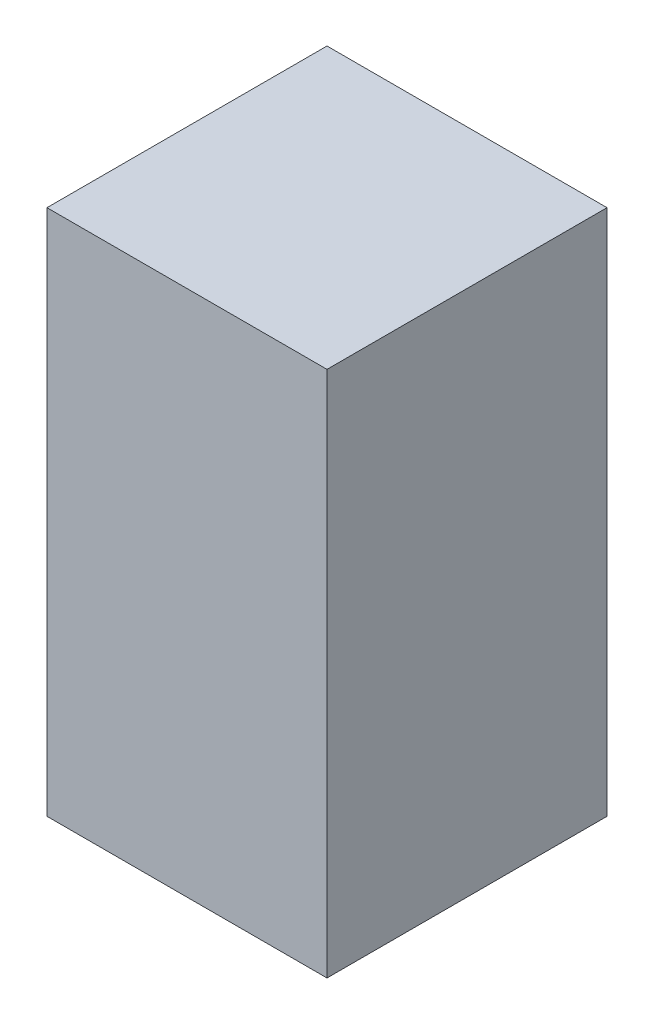
ISO-10303-21;
HEADER;
FILE_DESCRIPTION(('STEP AP214'),'2;1');
FILE_NAME('part.step','',(''),(''),'','','');
FILE_SCHEMA(('AUTOMOTIVE_DESIGN { 1 0 10303 214 1 1 1 1 }'));
ENDSEC;
DATA;
#1=APPLICATION_CONTEXT('core data for automotive mechanical design processes');
#2=APPLICATION_PROTOCOL_DEFINITION('international standard','automotive_design',2000,#1);
#3=PRODUCT_CONTEXT('',#1,'mechanical');
#4=PRODUCT('Part','Part','',(#3));
#5=PRODUCT_RELATED_PRODUCT_CATEGORY('part','',(#4));
#6=PRODUCT_DEFINITION_FORMATION('','',#4);
#7=PRODUCT_DEFINITION_CONTEXT('part definition',#1,'design');
#8=PRODUCT_DEFINITION('design','',#6,#7);
#9=PRODUCT_DEFINITION_SHAPE('','',#8);
#10=(LENGTH_UNIT() NAMED_UNIT(*) SI_UNIT(.MILLI.,.METRE.));
#11=(NAMED_UNIT(*) PLANE_ANGLE_UNIT() SI_UNIT($,.RADIAN.));
#12=(NAMED_UNIT(*) SI_UNIT($,.STERADIAN.) SOLID_ANGLE_UNIT());
#13=UNCERTAINTY_MEASURE_WITH_UNIT(LENGTH_MEASURE(1.E-05),#10,'distance_accuracy_value','');
#14=(GEOMETRIC_REPRESENTATION_CONTEXT(3) GLOBAL_UNCERTAINTY_ASSIGNED_CONTEXT((#13)) GLOBAL_UNIT_ASSIGNED_CONTEXT((#10,
#11,#12)) REPRESENTATION_CONTEXT('',''));
#15=CARTESIAN_POINT('',(0.,0.,0.));
#16=DIRECTION('',(0.,0.,1.));
#17=DIRECTION('',(1.,0.,0.));
#18=AXIS2_PLACEMENT_3D('',#15,#16,#17);
#19=CARTESIAN_POINT('',(26.9875,101.6,26.9875));
#20=DIRECTION('',(-1.,0.,0.));
#21=DIRECTION('',(0.,0.,1.));
#22=AXIS2_PLACEMENT_3D('',#19,#20,#21);
#23=PLANE('',#22);
#24=DIRECTION('',(0.,0.,-1.));
#25=VECTOR('',#24,1.);
#26=CARTESIAN_POINT('',(26.9875,0.,26.9875));
#27=LINE('',#26,#25);
#28=CARTESIAN_POINT('',(26.9875,0.,26.9875));
#29=VERTEX_POINT('',#28);
#30=CARTESIAN_POINT('',(26.9875,0.,-26.9875));
#31=VERTEX_POINT('',#30);
#32=EDGE_CURVE('E100',#29,#31,#27,.T.);
#33=ORIENTED_EDGE('',*,*,#32,.T.);
#34=DIRECTION('',(0.,-1.,0.));
#35=VECTOR('',#34,1.);
#36=CARTESIAN_POINT('',(26.9875,101.6,-26.9875));
#37=LINE('',#36,#35);
#38=CARTESIAN_POINT('',(26.9875,101.6,-26.9875));
#39=VERTEX_POINT('',#38);
#40=EDGE_CURVE('E11',#39,#31,#37,.T.);
#41=ORIENTED_EDGE('',*,*,#40,.F.);
#42=DIRECTION('',(0.,0.,-1.));
#43=VECTOR('',#42,1.);
#44=CARTESIAN_POINT('',(26.9875,101.6,26.9875));
#45=LINE('',#44,#43);
#46=CARTESIAN_POINT('',(26.9875,101.6,26.9875));
#47=VERTEX_POINT('',#46);
#48=EDGE_CURVE('E88',#47,#39,#45,.T.);
#49=ORIENTED_EDGE('',*,*,#48,.F.);
#50=DIRECTION('',(0.,-1.,0.));
#51=VECTOR('',#50,1.);
#52=CARTESIAN_POINT('',(26.9875,101.6,26.9875));
#53=LINE('',#52,#51);
#54=EDGE_CURVE('E96',#47,#29,#53,.T.);
#55=ORIENTED_EDGE('',*,*,#54,.T.);
#56=EDGE_LOOP('',(#33,#41,#49,#55));
#57=FACE_BOUND('',#56,.T.);
#58=ADVANCED_FACE('F37',(#57),#23,.F.);
#59=CARTESIAN_POINT('',(-26.9875,101.6,-26.9875));
#60=DIRECTION('',(0.,0.,1.));
#61=DIRECTION('',(1.,0.,0.));
#62=AXIS2_PLACEMENT_3D('',#59,#60,#61);
#63=PLANE('',#62);
#64=DIRECTION('',(-1.,0.,0.));
#65=VECTOR('',#64,1.);
#66=CARTESIAN_POINT('',(-26.9875,0.,-26.9875));
#67=LINE('',#66,#65);
#68=CARTESIAN_POINT('',(-26.9875,0.,-26.9875));
#69=VERTEX_POINT('',#68);
#70=EDGE_CURVE('E92',#31,#69,#67,.T.);
#71=ORIENTED_EDGE('',*,*,#70,.T.);
#72=DIRECTION('',(0.,-1.,0.));
#73=VECTOR('',#72,1.);
#74=CARTESIAN_POINT('',(-26.9875,101.6,-26.9875));
#75=LINE('',#74,#73);
#76=CARTESIAN_POINT('',(-26.9875,101.6,-26.9875));
#77=VERTEX_POINT('',#76);
#78=EDGE_CURVE('E45',#77,#69,#75,.T.);
#79=ORIENTED_EDGE('',*,*,#78,.F.);
#80=DIRECTION('',(-1.,0.,0.));
#81=VECTOR('',#80,1.);
#82=CARTESIAN_POINT('',(-26.9875,101.6,-26.9875));
#83=LINE('',#82,#81);
#84=EDGE_CURVE('E83',#39,#77,#83,.T.);
#85=ORIENTED_EDGE('',*,*,#84,.F.);
#86=ORIENTED_EDGE('',*,*,#40,.T.);
#87=EDGE_LOOP('',(#71,#79,#85,#86));
#88=FACE_BOUND('',#87,.T.);
#89=ADVANCED_FACE('F91',(#88),#63,.F.);
#90=CARTESIAN_POINT('',(-26.9875,101.6,26.9875));
#91=DIRECTION('',(1.,0.,0.));
#92=DIRECTION('',(0.,0.,-1.));
#93=AXIS2_PLACEMENT_3D('',#90,#91,#92);
#94=PLANE('',#93);
#95=DIRECTION('',(0.,0.,1.));
#96=VECTOR('',#95,1.);
#97=CARTESIAN_POINT('',(-26.9875,0.,26.9875));
#98=LINE('',#97,#96);
#99=CARTESIAN_POINT('',(-26.9875,0.,26.9875));
#100=VERTEX_POINT('',#99);
#101=EDGE_CURVE('E70',#69,#100,#98,.T.);
#102=ORIENTED_EDGE('',*,*,#101,.T.);
#103=DIRECTION('',(0.,-1.,0.));
#104=VECTOR('',#103,1.);
#105=CARTESIAN_POINT('',(-26.9875,101.6,26.9875));
#106=LINE('',#105,#104);
#107=CARTESIAN_POINT('',(-26.9875,101.6,26.9875));
#108=VERTEX_POINT('',#107);
#109=EDGE_CURVE('E93',#108,#100,#106,.T.);
#110=ORIENTED_EDGE('',*,*,#109,.F.);
#111=DIRECTION('',(0.,0.,1.));
#112=VECTOR('',#111,1.);
#113=CARTESIAN_POINT('',(-26.9875,101.6,26.9875));
#114=LINE('',#113,#112);
#115=EDGE_CURVE('E86',#77,#108,#114,.T.);
#116=ORIENTED_EDGE('',*,*,#115,.F.);
#117=ORIENTED_EDGE('',*,*,#78,.T.);
#118=EDGE_LOOP('',(#102,#110,#116,#117));
#119=FACE_BOUND('',#118,.T.);
#120=ADVANCED_FACE('F94',(#119),#94,.F.);
#121=CARTESIAN_POINT('',(-26.9875,101.6,26.9875));
#122=DIRECTION('',(0.,0.,-1.));
#123=DIRECTION('',(-1.,0.,0.));
#124=AXIS2_PLACEMENT_3D('',#121,#122,#123);
#125=PLANE('',#124);
#126=DIRECTION('',(1.,0.,0.));
#127=VECTOR('',#126,1.);
#128=CARTESIAN_POINT('',(-26.9875,0.,26.9875));
#129=LINE('',#128,#127);
#130=EDGE_CURVE('E76',#100,#29,#129,.T.);
#131=ORIENTED_EDGE('',*,*,#130,.T.);
#132=ORIENTED_EDGE('',*,*,#54,.F.);
#133=DIRECTION('',(1.,0.,0.));
#134=VECTOR('',#133,1.);
#135=CARTESIAN_POINT('',(-26.9875,101.6,26.9875));
#136=LINE('',#135,#134);
#137=EDGE_CURVE('E53',#108,#47,#136,.T.);
#138=ORIENTED_EDGE('',*,*,#137,.F.);
#139=ORIENTED_EDGE('',*,*,#109,.T.);
#140=EDGE_LOOP('',(#131,#132,#138,#139));
#141=FACE_BOUND('',#140,.T.);
#142=ADVANCED_FACE('F107',(#141),#125,.F.);
#143=CARTESIAN_POINT('',(0.,101.6,0.));
#144=DIRECTION('',(0.,-1.,0.));
#145=DIRECTION('',(0.,0.,-1.));
#146=AXIS2_PLACEMENT_3D('',#143,#144,#145);
#147=PLANE('',#146);
#148=ORIENTED_EDGE('',*,*,#48,.T.);
#149=ORIENTED_EDGE('',*,*,#84,.T.);
#150=ORIENTED_EDGE('',*,*,#115,.T.);
#151=ORIENTED_EDGE('',*,*,#137,.T.);
#152=EDGE_LOOP('',(#148,#149,#150,#151));
#153=FACE_BOUND('',#152,.T.);
#154=ADVANCED_FACE('F84',(#153),#147,.F.);
#155=CARTESIAN_POINT('',(0.,0.,0.));
#156=DIRECTION('',(0.,-1.,0.));
#157=DIRECTION('',(0.,0.,-1.));
#158=AXIS2_PLACEMENT_3D('',#155,#156,#157);
#159=PLANE('',#158);
#160=ORIENTED_EDGE('',*,*,#32,.F.);
#161=ORIENTED_EDGE('',*,*,#130,.F.);
#162=ORIENTED_EDGE('',*,*,#101,.F.);
#163=ORIENTED_EDGE('',*,*,#70,.F.);
#164=EDGE_LOOP('',(#160,#161,#162,#163));
#165=FACE_BOUND('',#164,.T.);
#166=ADVANCED_FACE('F110',(#165),#159,.T.);
#167=CLOSED_SHELL('',(#58,#89,#120,#142,#154,#166));
#168=MANIFOLD_SOLID_BREP('B2',#167);
#169=ADVANCED_BREP_SHAPE_REPRESENTATION('',(#18,#168),#14);
#170=SHAPE_DEFINITION_REPRESENTATION(#9,#169);
ENDSEC;
END-ISO-10303-21;
